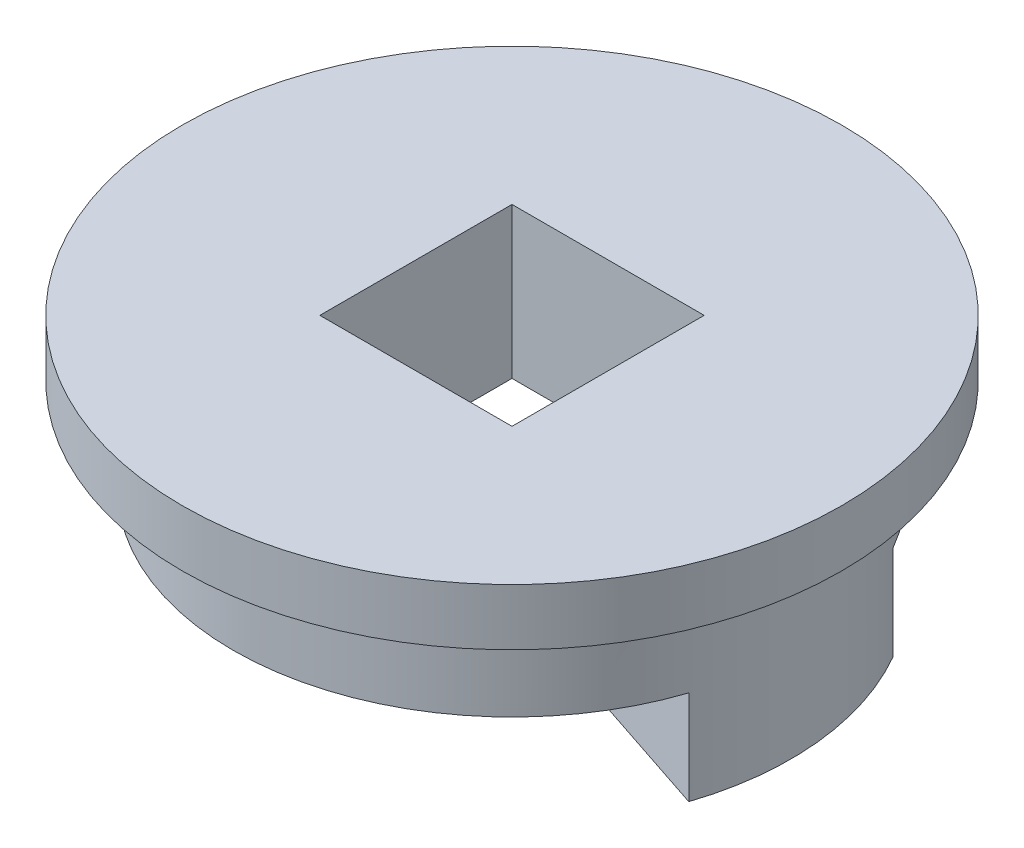
ISO-10303-21;
HEADER;
FILE_DESCRIPTION(('STEP AP214'),'2;1');
FILE_NAME('part.step','',(''),(''),'','','');
FILE_SCHEMA(('AUTOMOTIVE_DESIGN { 1 0 10303 214 1 1 1 1 }'));
ENDSEC;
DATA;
#1=APPLICATION_CONTEXT('core data for automotive mechanical design processes');
#2=APPLICATION_PROTOCOL_DEFINITION('international standard','automotive_design',2000,#1);
#3=PRODUCT_CONTEXT('',#1,'mechanical');
#4=PRODUCT('Part','Part','',(#3));
#5=PRODUCT_RELATED_PRODUCT_CATEGORY('part','',(#4));
#6=PRODUCT_DEFINITION_FORMATION('','',#4);
#7=PRODUCT_DEFINITION_CONTEXT('part definition',#1,'design');
#8=PRODUCT_DEFINITION('design','',#6,#7);
#9=PRODUCT_DEFINITION_SHAPE('','',#8);
#10=(LENGTH_UNIT() NAMED_UNIT(*) SI_UNIT(.MILLI.,.METRE.));
#11=(NAMED_UNIT(*) PLANE_ANGLE_UNIT() SI_UNIT($,.RADIAN.));
#12=(NAMED_UNIT(*) SI_UNIT($,.STERADIAN.) SOLID_ANGLE_UNIT());
#13=UNCERTAINTY_MEASURE_WITH_UNIT(LENGTH_MEASURE(1.E-05),#10,'distance_accuracy_value','');
#14=(GEOMETRIC_REPRESENTATION_CONTEXT(3) GLOBAL_UNCERTAINTY_ASSIGNED_CONTEXT((#13)) GLOBAL_UNIT_ASSIGNED_CONTEXT((#10,
#11,#12)) REPRESENTATION_CONTEXT('',''));
#15=CARTESIAN_POINT('',(0.,0.,0.));
#16=DIRECTION('',(0.,0.,1.));
#17=DIRECTION('',(1.,0.,0.));
#18=AXIS2_PLACEMENT_3D('',#15,#16,#17);
#19=CARTESIAN_POINT('',(0.,0.,0.));
#20=DIRECTION('',(0.,1.,0.));
#21=DIRECTION('',(0.,0.,1.));
#22=AXIS2_PLACEMENT_3D('',#19,#20,#21);
#23=PLANE('',#22);
#24=DIRECTION('',(0.866025403784438,0.,-0.500000000000001));
#25=VECTOR('',#24,1.);
#26=CARTESIAN_POINT('',(5.1,0.,-2.9444863728671));
#27=LINE('',#26,#25);
#28=CARTESIAN_POINT('',(5.1,0.,-2.9444863728671));
#29=VERTEX_POINT('',#28);
#30=CARTESIAN_POINT('',(12.8171759760097,0.,-7.40000000000002));
#31=VERTEX_POINT('',#30);
#32=EDGE_CURVE('E115',#29,#31,#27,.T.);
#33=ORIENTED_EDGE('',*,*,#32,.F.);
#34=DIRECTION('',(0.,0.,-1.));
#35=VECTOR('',#34,1.);
#36=CARTESIAN_POINT('',(5.1,0.,5.1));
#37=LINE('',#36,#35);
#38=CARTESIAN_POINT('',(5.1,0.,-5.1));
#39=VERTEX_POINT('',#38);
#40=EDGE_CURVE('E128',#29,#39,#37,.T.);
#41=ORIENTED_EDGE('',*,*,#40,.T.);
#42=DIRECTION('',(-1.,0.,0.));
#43=VECTOR('',#42,1.);
#44=CARTESIAN_POINT('',(-5.1,0.,-5.1));
#45=LINE('',#44,#43);
#46=CARTESIAN_POINT('',(-5.1,0.,-5.1));
#47=VERTEX_POINT('',#46);
#48=EDGE_CURVE('E127',#39,#47,#45,.T.);
#49=ORIENTED_EDGE('',*,*,#48,.T.);
#50=DIRECTION('',(0.,0.,1.));
#51=VECTOR('',#50,1.);
#52=CARTESIAN_POINT('',(-5.1,0.,5.1));
#53=LINE('',#52,#51);
#54=CARTESIAN_POINT('',(-5.1,0.,5.1));
#55=VERTEX_POINT('',#54);
#56=EDGE_CURVE('E131',#47,#55,#53,.T.);
#57=ORIENTED_EDGE('',*,*,#56,.T.);
#58=DIRECTION('',(1.,0.,0.));
#59=VECTOR('',#58,1.);
#60=CARTESIAN_POINT('',(-5.1,0.,5.1));
#61=LINE('',#60,#59);
#62=CARTESIAN_POINT('',(5.1,0.,5.1));
#63=VERTEX_POINT('',#62);
#64=EDGE_CURVE('E134',#55,#63,#61,.T.);
#65=ORIENTED_EDGE('',*,*,#64,.T.);
#66=CARTESIAN_POINT('',(5.1,0.,1.69318501699199));
#67=VERTEX_POINT('',#66);
#68=EDGE_CURVE('E125',#63,#67,#37,.T.);
#69=ORIENTED_EDGE('',*,*,#68,.T.);
#70=DIRECTION('',(-0.949063073124753,0.,-0.315086152077492));
#71=VECTOR('',#70,1.);
#72=CARTESIAN_POINT('',(14.0461334822463,0.,4.66327505074688));
#73=LINE('',#72,#71);
#74=CARTESIAN_POINT('',(14.0461334822463,0.,4.66327505074688));
#75=VERTEX_POINT('',#74);
#76=EDGE_CURVE('E53',#75,#67,#73,.T.);
#77=ORIENTED_EDGE('',*,*,#76,.F.);
#78=CARTESIAN_POINT('',(0.,0.,0.));
#79=DIRECTION('',(0.,1.,0.));
#80=DIRECTION('',(0.,0.,1.));
#81=AXIS2_PLACEMENT_3D('',#78,#79,#80);
#82=CIRCLE('',#81,14.8);
#83=EDGE_CURVE('E38',#31,#75,#82,.T.);
#84=ORIENTED_EDGE('',*,*,#83,.F.);
#85=EDGE_LOOP('',(#33,#41,#49,#57,#65,#69,#77,#84));
#86=FACE_BOUND('',#85,.T.);
#87=ADVANCED_FACE('F34',(#86),#23,.F.);
#88=CARTESIAN_POINT('',(0.,5.,0.));
#89=DIRECTION('',(0.,-1.,0.));
#90=DIRECTION('',(0.,0.,-1.));
#91=AXIS2_PLACEMENT_3D('',#88,#89,#90);
#92=CYLINDRICAL_SURFACE('',#91,14.8);
#93=CARTESIAN_POINT('',(0.,5.,0.));
#94=DIRECTION('',(0.,1.,0.));
#95=DIRECTION('',(0.,0.,1.));
#96=AXIS2_PLACEMENT_3D('',#93,#94,#95);
#97=CIRCLE('',#96,14.8);
#98=CARTESIAN_POINT('',(0.,5.,14.8));
#99=VERTEX_POINT('',#98);
#100=EDGE_CURVE('E11',#99,#99,#97,.T.);
#101=ORIENTED_EDGE('',*,*,#100,.F.);
#102=EDGE_LOOP('',(#101));
#103=FACE_BOUND('',#102,.T.);
#104=ORIENTED_EDGE('',*,*,#83,.T.);
#105=DIRECTION('',(0.,1.,0.));
#106=VECTOR('',#105,1.);
#107=CARTESIAN_POINT('',(14.0461334822463,-5.,4.66327505074688));
#108=LINE('',#107,#106);
#109=CARTESIAN_POINT('',(14.0461334822463,-5.,4.66327505074688));
#110=VERTEX_POINT('',#109);
#111=EDGE_CURVE('E100',#110,#75,#108,.T.);
#112=ORIENTED_EDGE('',*,*,#111,.F.);
#113=CARTESIAN_POINT('',(-1.97758476261356E-13,-5.,0.));
#114=DIRECTION('',(0.,-1.,0.));
#115=DIRECTION('',(0.,0.,1.));
#116=AXIS2_PLACEMENT_3D('',#113,#114,#115);
#117=CIRCLE('',#116,14.8000000000002);
#118=CARTESIAN_POINT('',(12.8171759760097,-5.,-7.40000000000002));
#119=VERTEX_POINT('',#118);
#120=EDGE_CURVE('E106',#119,#110,#117,.T.);
#121=ORIENTED_EDGE('',*,*,#120,.F.);
#122=DIRECTION('',(0.,1.,0.));
#123=VECTOR('',#122,1.);
#124=CARTESIAN_POINT('',(12.8171759760097,-5.,-7.40000000000002));
#125=LINE('',#124,#123);
#126=EDGE_CURVE('E274',#119,#31,#125,.T.);
#127=ORIENTED_EDGE('',*,*,#126,.T.);
#128=EDGE_LOOP('',(#104,#112,#121,#127));
#129=FACE_BOUND('',#128,.T.);
#130=ADVANCED_FACE('F36',(#103,#129),#92,.T.);
#131=CARTESIAN_POINT('',(0.,8.,0.));
#132=DIRECTION('',(0.,-1.,0.));
#133=DIRECTION('',(0.,0.,-1.));
#134=AXIS2_PLACEMENT_3D('',#131,#132,#133);
#135=CYLINDRICAL_SURFACE('',#134,17.5);
#136=CARTESIAN_POINT('',(0.,8.,0.));
#137=DIRECTION('',(0.,1.,0.));
#138=DIRECTION('',(0.,0.,1.));
#139=AXIS2_PLACEMENT_3D('',#136,#137,#138);
#140=CIRCLE('',#139,17.5);
#141=CARTESIAN_POINT('',(0.,8.,17.5));
#142=VERTEX_POINT('',#141);
#143=EDGE_CURVE('E155',#142,#142,#140,.T.);
#144=ORIENTED_EDGE('',*,*,#143,.F.);
#145=EDGE_LOOP('',(#144));
#146=FACE_BOUND('',#145,.T.);
#147=CARTESIAN_POINT('',(0.,5.,0.));
#148=DIRECTION('',(0.,1.,0.));
#149=DIRECTION('',(0.,0.,1.));
#150=AXIS2_PLACEMENT_3D('',#147,#148,#149);
#151=CIRCLE('',#150,17.5);
#152=CARTESIAN_POINT('',(0.,5.,17.5));
#153=VERTEX_POINT('',#152);
#154=EDGE_CURVE('E148',#153,#153,#151,.T.);
#155=ORIENTED_EDGE('',*,*,#154,.T.);
#156=EDGE_LOOP('',(#155));
#157=FACE_BOUND('',#156,.T.);
#158=ADVANCED_FACE('F161',(#146,#157),#135,.T.);
#159=CARTESIAN_POINT('',(0.,8.,0.));
#160=DIRECTION('',(0.,1.,0.));
#161=DIRECTION('',(0.,0.,1.));
#162=AXIS2_PLACEMENT_3D('',#159,#160,#161);
#163=PLANE('',#162);
#164=DIRECTION('',(0.,0.,-1.));
#165=VECTOR('',#164,1.);
#166=CARTESIAN_POINT('',(5.1,8.,5.1));
#167=LINE('',#166,#165);
#168=CARTESIAN_POINT('',(5.1,8.,5.1));
#169=VERTEX_POINT('',#168);
#170=CARTESIAN_POINT('',(5.1,8.,-5.1));
#171=VERTEX_POINT('',#170);
#172=EDGE_CURVE('E117',#169,#171,#167,.T.);
#173=ORIENTED_EDGE('',*,*,#172,.F.);
#174=DIRECTION('',(1.,0.,0.));
#175=VECTOR('',#174,1.);
#176=CARTESIAN_POINT('',(-5.1,8.,5.1));
#177=LINE('',#176,#175);
#178=CARTESIAN_POINT('',(-5.1,8.,5.1));
#179=VERTEX_POINT('',#178);
#180=EDGE_CURVE('E143',#179,#169,#177,.T.);
#181=ORIENTED_EDGE('',*,*,#180,.F.);
#182=DIRECTION('',(0.,0.,1.));
#183=VECTOR('',#182,1.);
#184=CARTESIAN_POINT('',(-5.1,8.,5.1));
#185=LINE('',#184,#183);
#186=CARTESIAN_POINT('',(-5.1,8.,-5.1));
#187=VERTEX_POINT('',#186);
#188=EDGE_CURVE('E140',#187,#179,#185,.T.);
#189=ORIENTED_EDGE('',*,*,#188,.F.);
#190=DIRECTION('',(-1.,0.,0.));
#191=VECTOR('',#190,1.);
#192=CARTESIAN_POINT('',(-5.1,8.,-5.1));
#193=LINE('',#192,#191);
#194=EDGE_CURVE('E119',#171,#187,#193,.T.);
#195=ORIENTED_EDGE('',*,*,#194,.F.);
#196=EDGE_LOOP('',(#173,#181,#189,#195));
#197=FACE_BOUND('',#196,.T.);
#198=ORIENTED_EDGE('',*,*,#143,.T.);
#199=EDGE_LOOP('',(#198));
#200=FACE_BOUND('',#199,.T.);
#201=ADVANCED_FACE('F166',(#197,#200),#163,.T.);
#202=CARTESIAN_POINT('',(0.,5.,0.));
#203=DIRECTION('',(0.,1.,0.));
#204=DIRECTION('',(0.,0.,1.));
#205=AXIS2_PLACEMENT_3D('',#202,#203,#204);
#206=PLANE('',#205);
#207=ORIENTED_EDGE('',*,*,#100,.T.);
#208=EDGE_LOOP('',(#207));
#209=FACE_BOUND('',#208,.T.);
#210=ORIENTED_EDGE('',*,*,#154,.F.);
#211=EDGE_LOOP('',(#210));
#212=FACE_BOUND('',#211,.T.);
#213=ADVANCED_FACE('F163',(#209,#212),#206,.F.);
#214=CARTESIAN_POINT('',(5.1,0.,5.1));
#215=DIRECTION('',(1.,0.,0.));
#216=DIRECTION('',(0.,0.,-1.));
#217=AXIS2_PLACEMENT_3D('',#214,#215,#216);
#218=PLANE('',#217);
#219=ORIENTED_EDGE('',*,*,#172,.T.);
#220=DIRECTION('',(0.,1.,0.));
#221=VECTOR('',#220,1.);
#222=CARTESIAN_POINT('',(5.1,0.,-5.1));
#223=LINE('',#222,#221);
#224=EDGE_CURVE('E136',#39,#171,#223,.T.);
#225=ORIENTED_EDGE('',*,*,#224,.F.);
#226=ORIENTED_EDGE('',*,*,#40,.F.);
#227=DIRECTION('',(0.,1.,0.));
#228=VECTOR('',#227,1.);
#229=CARTESIAN_POINT('',(5.1,-5.,-2.9444863728671));
#230=LINE('',#229,#228);
#231=CARTESIAN_POINT('',(5.1,-5.,-2.9444863728671));
#232=VERTEX_POINT('',#231);
#233=EDGE_CURVE('E121',#232,#29,#230,.T.);
#234=ORIENTED_EDGE('',*,*,#233,.F.);
#235=DIRECTION('',(0.,0.,-1.));
#236=VECTOR('',#235,1.);
#237=CARTESIAN_POINT('',(5.1,-5.,1.69318501699199));
#238=LINE('',#237,#236);
#239=CARTESIAN_POINT('',(5.1,-5.,1.69318501699199));
#240=VERTEX_POINT('',#239);
#241=EDGE_CURVE('E105',#240,#232,#238,.T.);
#242=ORIENTED_EDGE('',*,*,#241,.F.);
#243=DIRECTION('',(0.,1.,0.));
#244=VECTOR('',#243,1.);
#245=CARTESIAN_POINT('',(5.1,-5.,1.69318501699199));
#246=LINE('',#245,#244);
#247=EDGE_CURVE('E102',#240,#67,#246,.T.);
#248=ORIENTED_EDGE('',*,*,#247,.T.);
#249=ORIENTED_EDGE('',*,*,#68,.F.);
#250=DIRECTION('',(0.,1.,0.));
#251=VECTOR('',#250,1.);
#252=CARTESIAN_POINT('',(5.1,0.,5.1));
#253=LINE('',#252,#251);
#254=EDGE_CURVE('E146',#63,#169,#253,.T.);
#255=ORIENTED_EDGE('',*,*,#254,.T.);
#256=EDGE_LOOP('',(#219,#225,#226,#234,#242,#248,#249,#255));
#257=FACE_BOUND('',#256,.T.);
#258=ADVANCED_FACE('F165',(#257),#218,.F.);
#259=CARTESIAN_POINT('',(-5.1,0.,5.1));
#260=DIRECTION('',(0.,0.,1.));
#261=DIRECTION('',(1.,0.,0.));
#262=AXIS2_PLACEMENT_3D('',#259,#260,#261);
#263=PLANE('',#262);
#264=ORIENTED_EDGE('',*,*,#180,.T.);
#265=ORIENTED_EDGE('',*,*,#254,.F.);
#266=ORIENTED_EDGE('',*,*,#64,.F.);
#267=DIRECTION('',(0.,1.,0.));
#268=VECTOR('',#267,1.);
#269=CARTESIAN_POINT('',(-5.1,0.,5.1));
#270=LINE('',#269,#268);
#271=EDGE_CURVE('E149',#55,#179,#270,.T.);
#272=ORIENTED_EDGE('',*,*,#271,.T.);
#273=EDGE_LOOP('',(#264,#265,#266,#272));
#274=FACE_BOUND('',#273,.T.);
#275=ADVANCED_FACE('F173',(#274),#263,.F.);
#276=CARTESIAN_POINT('',(-5.1,0.,5.1));
#277=DIRECTION('',(-1.,0.,0.));
#278=DIRECTION('',(0.,0.,1.));
#279=AXIS2_PLACEMENT_3D('',#276,#277,#278);
#280=PLANE('',#279);
#281=ORIENTED_EDGE('',*,*,#188,.T.);
#282=ORIENTED_EDGE('',*,*,#271,.F.);
#283=ORIENTED_EDGE('',*,*,#56,.F.);
#284=DIRECTION('',(0.,1.,0.));
#285=VECTOR('',#284,1.);
#286=CARTESIAN_POINT('',(-5.1,0.,-5.1));
#287=LINE('',#286,#285);
#288=EDGE_CURVE('E151',#47,#187,#287,.T.);
#289=ORIENTED_EDGE('',*,*,#288,.T.);
#290=EDGE_LOOP('',(#281,#282,#283,#289));
#291=FACE_BOUND('',#290,.T.);
#292=ADVANCED_FACE('F207',(#291),#280,.F.);
#293=CARTESIAN_POINT('',(-5.1,0.,-5.1));
#294=DIRECTION('',(0.,0.,-1.));
#295=DIRECTION('',(-1.,0.,0.));
#296=AXIS2_PLACEMENT_3D('',#293,#294,#295);
#297=PLANE('',#296);
#298=ORIENTED_EDGE('',*,*,#194,.T.);
#299=ORIENTED_EDGE('',*,*,#288,.F.);
#300=ORIENTED_EDGE('',*,*,#48,.F.);
#301=ORIENTED_EDGE('',*,*,#224,.T.);
#302=EDGE_LOOP('',(#298,#299,#300,#301));
#303=FACE_BOUND('',#302,.T.);
#304=ADVANCED_FACE('F218',(#303),#297,.F.);
#305=CARTESIAN_POINT('',(14.0461334822463,-5.,4.66327505074688));
#306=DIRECTION('',(0.315086152077492,0.,-0.949063073124753));
#307=DIRECTION('',(-0.949063073124753,0.,-0.315086152077492));
#308=AXIS2_PLACEMENT_3D('',#305,#306,#307);
#309=PLANE('',#308);
#310=ORIENTED_EDGE('',*,*,#76,.T.);
#311=ORIENTED_EDGE('',*,*,#247,.F.);
#312=DIRECTION('',(-0.949063073124753,0.,-0.315086152077492));
#313=VECTOR('',#312,1.);
#314=CARTESIAN_POINT('',(14.0461334822463,-5.,4.66327505074688));
#315=LINE('',#314,#313);
#316=EDGE_CURVE('E96',#110,#240,#315,.T.);
#317=ORIENTED_EDGE('',*,*,#316,.F.);
#318=ORIENTED_EDGE('',*,*,#111,.T.);
#319=EDGE_LOOP('',(#310,#311,#317,#318));
#320=FACE_BOUND('',#319,.T.);
#321=ADVANCED_FACE('F98',(#320),#309,.F.);
#322=CARTESIAN_POINT('',(5.1,-5.,-2.9444863728671));
#323=DIRECTION('',(0.500000000000001,0.,0.866025403784438));
#324=DIRECTION('',(0.866025403784438,0.,-0.500000000000001));
#325=AXIS2_PLACEMENT_3D('',#322,#323,#324);
#326=PLANE('',#325);
#327=ORIENTED_EDGE('',*,*,#32,.T.);
#328=ORIENTED_EDGE('',*,*,#126,.F.);
#329=DIRECTION('',(0.866025403784438,0.,-0.500000000000001));
#330=VECTOR('',#329,1.);
#331=CARTESIAN_POINT('',(5.1,-5.,-2.9444863728671));
#332=LINE('',#331,#330);
#333=EDGE_CURVE('E111',#232,#119,#332,.T.);
#334=ORIENTED_EDGE('',*,*,#333,.F.);
#335=ORIENTED_EDGE('',*,*,#233,.T.);
#336=EDGE_LOOP('',(#327,#328,#334,#335));
#337=FACE_BOUND('',#336,.T.);
#338=ADVANCED_FACE('F252',(#337),#326,.F.);
#339=CARTESIAN_POINT('',(-1.97758476261356E-13,-5.,0.));
#340=DIRECTION('',(0.,1.,0.));
#341=DIRECTION('',(0.,0.,1.));
#342=AXIS2_PLACEMENT_3D('',#339,#340,#341);
#343=PLANE('',#342);
#344=ORIENTED_EDGE('',*,*,#120,.T.);
#345=ORIENTED_EDGE('',*,*,#316,.T.);
#346=ORIENTED_EDGE('',*,*,#241,.T.);
#347=ORIENTED_EDGE('',*,*,#333,.T.);
#348=EDGE_LOOP('',(#344,#345,#346,#347));
#349=FACE_BOUND('',#348,.T.);
#350=ADVANCED_FACE('F109',(#349),#343,.F.);
#351=CLOSED_SHELL('',(#87,#130,#158,#201,#213,#258,#275,#292,#304,#321,#338,#350));
#352=MANIFOLD_SOLID_BREP('B2',#351);
#353=ADVANCED_BREP_SHAPE_REPRESENTATION('',(#18,#352),#14);
#354=SHAPE_DEFINITION_REPRESENTATION(#9,#353);
ENDSEC;
END-ISO-10303-21;
